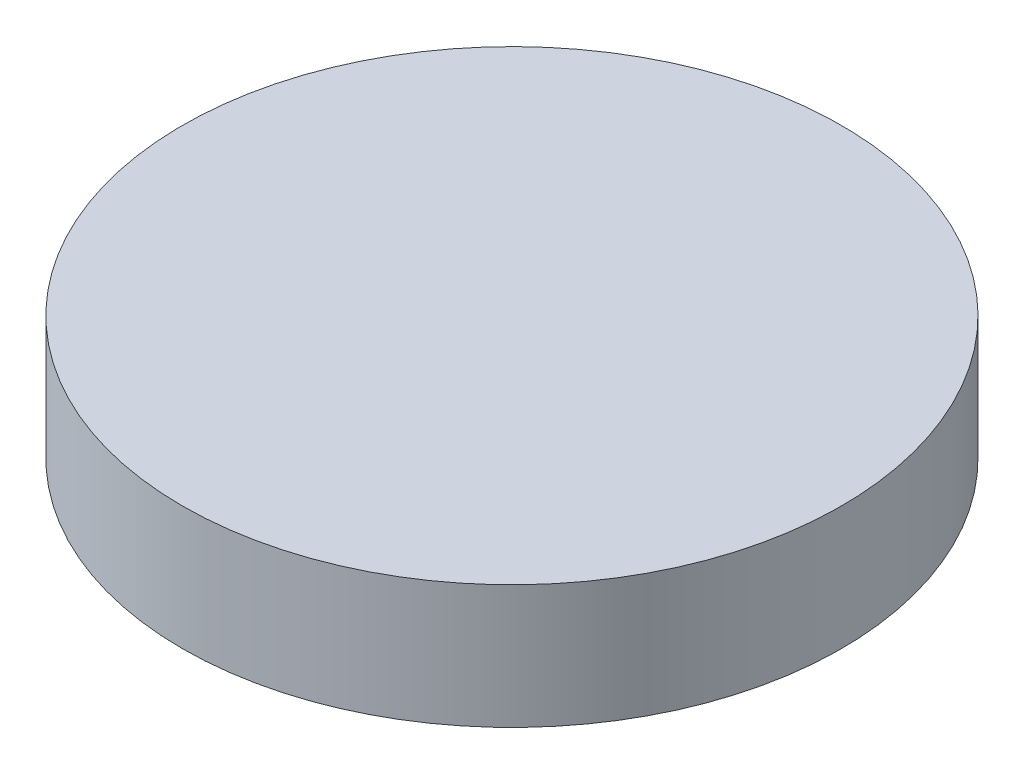
ISO-10303-21;
HEADER;
FILE_DESCRIPTION(('STEP AP214'),'2;1');
FILE_NAME('part.step','',(''),(''),'','','');
FILE_SCHEMA(('AUTOMOTIVE_DESIGN { 1 0 10303 214 1 1 1 1 }'));
ENDSEC;
DATA;
#1=APPLICATION_CONTEXT('core data for automotive mechanical design processes');
#2=APPLICATION_PROTOCOL_DEFINITION('international standard','automotive_design',2000,#1);
#3=PRODUCT_CONTEXT('',#1,'mechanical');
#4=PRODUCT('Part','Part','',(#3));
#5=PRODUCT_RELATED_PRODUCT_CATEGORY('part','',(#4));
#6=PRODUCT_DEFINITION_FORMATION('','',#4);
#7=PRODUCT_DEFINITION_CONTEXT('part definition',#1,'design');
#8=PRODUCT_DEFINITION('design','',#6,#7);
#9=PRODUCT_DEFINITION_SHAPE('','',#8);
#10=(LENGTH_UNIT() NAMED_UNIT(*) SI_UNIT(.MILLI.,.METRE.));
#11=(NAMED_UNIT(*) PLANE_ANGLE_UNIT() SI_UNIT($,.RADIAN.));
#12=(NAMED_UNIT(*) SI_UNIT($,.STERADIAN.) SOLID_ANGLE_UNIT());
#13=UNCERTAINTY_MEASURE_WITH_UNIT(LENGTH_MEASURE(1.E-05),#10,'distance_accuracy_value','');
#14=(GEOMETRIC_REPRESENTATION_CONTEXT(3) GLOBAL_UNCERTAINTY_ASSIGNED_CONTEXT((#13)) GLOBAL_UNIT_ASSIGNED_CONTEXT((#10,
#11,#12)) REPRESENTATION_CONTEXT('',''));
#15=CARTESIAN_POINT('',(0.,0.,0.));
#16=DIRECTION('',(0.,0.,1.));
#17=DIRECTION('',(1.,0.,0.));
#18=AXIS2_PLACEMENT_3D('',#15,#16,#17);
#19=CARTESIAN_POINT('',(0.,3.,0.));
#20=DIRECTION('',(0.,-1.,0.));
#21=DIRECTION('',(0.,0.,-1.));
#22=AXIS2_PLACEMENT_3D('',#19,#20,#21);
#23=CYLINDRICAL_SURFACE('',#22,8.);
#24=CARTESIAN_POINT('',(0.,3.,0.));
#25=DIRECTION('',(0.,1.,0.));
#26=DIRECTION('',(0.,0.,1.));
#27=AXIS2_PLACEMENT_3D('',#24,#25,#26);
#28=CIRCLE('',#27,8.);
#29=CARTESIAN_POINT('',(0.,3.,8.));
#30=VERTEX_POINT('',#29);
#31=EDGE_CURVE('E10',#30,#30,#28,.T.);
#32=ORIENTED_EDGE('',*,*,#31,.F.);
#33=EDGE_LOOP('',(#32));
#34=FACE_BOUND('',#33,.T.);
#35=CARTESIAN_POINT('',(0.,0.,0.));
#36=DIRECTION('',(0.,1.,0.));
#37=DIRECTION('',(0.,0.,1.));
#38=AXIS2_PLACEMENT_3D('',#35,#36,#37);
#39=CIRCLE('',#38,8.);
#40=CARTESIAN_POINT('',(0.,0.,8.));
#41=VERTEX_POINT('',#40);
#42=EDGE_CURVE('E34',#41,#41,#39,.T.);
#43=ORIENTED_EDGE('',*,*,#42,.T.);
#44=EDGE_LOOP('',(#43));
#45=FACE_BOUND('',#44,.T.);
#46=ADVANCED_FACE('F31',(#34,#45),#23,.T.);
#47=CARTESIAN_POINT('',(0.,3.,0.));
#48=DIRECTION('',(0.,1.,0.));
#49=DIRECTION('',(0.,0.,1.));
#50=AXIS2_PLACEMENT_3D('',#47,#48,#49);
#51=PLANE('',#50);
#52=ORIENTED_EDGE('',*,*,#31,.T.);
#53=EDGE_LOOP('',(#52));
#54=FACE_BOUND('',#53,.T.);
#55=ADVANCED_FACE('F46',(#54),#51,.T.);
#56=CARTESIAN_POINT('',(0.,0.,0.));
#57=DIRECTION('',(0.,1.,0.));
#58=DIRECTION('',(0.,0.,1.));
#59=AXIS2_PLACEMENT_3D('',#56,#57,#58);
#60=PLANE('',#59);
#61=ORIENTED_EDGE('',*,*,#42,.F.);
#62=EDGE_LOOP('',(#61));
#63=FACE_BOUND('',#62,.T.);
#64=ADVANCED_FACE('F44',(#63),#60,.F.);
#65=CLOSED_SHELL('',(#46,#55,#64));
#66=MANIFOLD_SOLID_BREP('B2',#65);
#67=ADVANCED_BREP_SHAPE_REPRESENTATION('',(#18,#66),#14);
#68=SHAPE_DEFINITION_REPRESENTATION(#9,#67);
ENDSEC;
END-ISO-10303-21;
